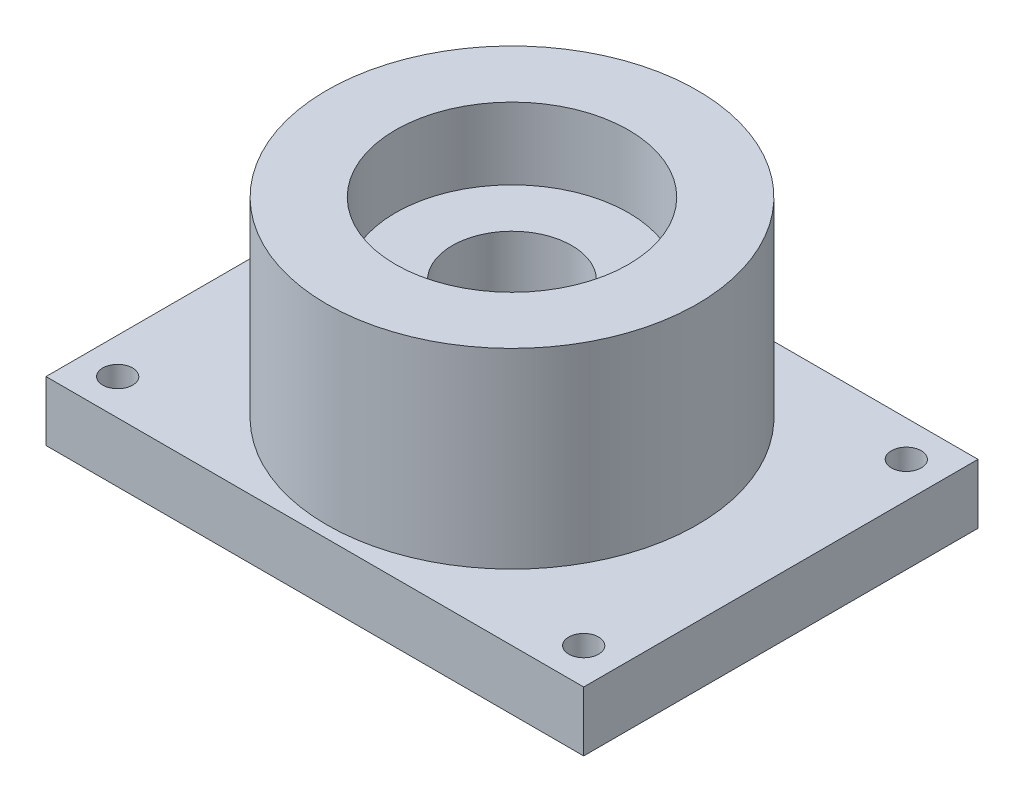
ISO-10303-21;
HEADER;
FILE_DESCRIPTION(('STEP AP214'),'2;1');
FILE_NAME('part.step','',(''),(''),'','','');
FILE_SCHEMA(('AUTOMOTIVE_DESIGN { 1 0 10303 214 1 1 1 1 }'));
ENDSEC;
DATA;
#1=APPLICATION_CONTEXT('core data for automotive mechanical design processes');
#2=APPLICATION_PROTOCOL_DEFINITION('international standard','automotive_design',2000,#1);
#3=PRODUCT_CONTEXT('',#1,'mechanical');
#4=PRODUCT('Part','Part','',(#3));
#5=PRODUCT_RELATED_PRODUCT_CATEGORY('part','',(#4));
#6=PRODUCT_DEFINITION_FORMATION('','',#4);
#7=PRODUCT_DEFINITION_CONTEXT('part definition',#1,'design');
#8=PRODUCT_DEFINITION('design','',#6,#7);
#9=PRODUCT_DEFINITION_SHAPE('','',#8);
#10=(LENGTH_UNIT() NAMED_UNIT(*) SI_UNIT(.MILLI.,.METRE.));
#11=(NAMED_UNIT(*) PLANE_ANGLE_UNIT() SI_UNIT($,.RADIAN.));
#12=(NAMED_UNIT(*) SI_UNIT($,.STERADIAN.) SOLID_ANGLE_UNIT());
#13=UNCERTAINTY_MEASURE_WITH_UNIT(LENGTH_MEASURE(1.E-05),#10,'distance_accuracy_value','');
#14=(GEOMETRIC_REPRESENTATION_CONTEXT(3) GLOBAL_UNCERTAINTY_ASSIGNED_CONTEXT((#13)) GLOBAL_UNIT_ASSIGNED_CONTEXT((#10,
#11,#12)) REPRESENTATION_CONTEXT('',''));
#15=CARTESIAN_POINT('',(0.,0.,0.));
#16=DIRECTION('',(0.,0.,1.));
#17=DIRECTION('',(1.,0.,0.));
#18=AXIS2_PLACEMENT_3D('',#15,#16,#17);
#19=CARTESIAN_POINT('',(0.,16.,0.));
#20=DIRECTION('',(0.,-1.,0.));
#21=DIRECTION('',(0.,0.,-1.));
#22=AXIS2_PLACEMENT_3D('',#19,#20,#21);
#23=CYLINDRICAL_SURFACE('',#22,15.5);
#24=CARTESIAN_POINT('',(0.,16.,0.));
#25=DIRECTION('',(0.,1.,0.));
#26=DIRECTION('',(0.,0.,1.));
#27=AXIS2_PLACEMENT_3D('',#24,#25,#26);
#28=CIRCLE('',#27,15.5);
#29=CARTESIAN_POINT('',(0.,16.,15.5));
#30=VERTEX_POINT('',#29);
#31=EDGE_CURVE('E11',#30,#30,#28,.T.);
#32=ORIENTED_EDGE('',*,*,#31,.F.);
#33=EDGE_LOOP('',(#32));
#34=FACE_BOUND('',#33,.T.);
#35=CARTESIAN_POINT('',(0.,0.,0.));
#36=DIRECTION('',(0.,1.,0.));
#37=DIRECTION('',(0.,0.,1.));
#38=AXIS2_PLACEMENT_3D('',#35,#36,#37);
#39=CIRCLE('',#38,15.5);
#40=CARTESIAN_POINT('',(0.,0.,15.5));
#41=VERTEX_POINT('',#40);
#42=EDGE_CURVE('E42',#41,#41,#39,.T.);
#43=ORIENTED_EDGE('',*,*,#42,.T.);
#44=EDGE_LOOP('',(#43));
#45=FACE_BOUND('',#44,.T.);
#46=ADVANCED_FACE('F33',(#34,#45),#23,.T.);
#47=CARTESIAN_POINT('',(0.,16.,0.));
#48=DIRECTION('',(0.,1.,0.));
#49=DIRECTION('',(0.,0.,1.));
#50=AXIS2_PLACEMENT_3D('',#47,#48,#49);
#51=PLANE('',#50);
#52=CARTESIAN_POINT('',(0.,16.,0.));
#53=DIRECTION('',(0.,1.,0.));
#54=DIRECTION('',(0.,0.,1.));
#55=AXIS2_PLACEMENT_3D('',#52,#53,#54);
#56=CIRCLE('',#55,9.75);
#57=CARTESIAN_POINT('',(0.,16.,9.75));
#58=VERTEX_POINT('',#57);
#59=EDGE_CURVE('E145',#58,#58,#56,.T.);
#60=ORIENTED_EDGE('',*,*,#59,.F.);
#61=EDGE_LOOP('',(#60));
#62=FACE_BOUND('',#61,.T.);
#63=ORIENTED_EDGE('',*,*,#31,.T.);
#64=EDGE_LOOP('',(#63));
#65=FACE_BOUND('',#64,.T.);
#66=ADVANCED_FACE('F165',(#62,#65),#51,.T.);
#67=CARTESIAN_POINT('',(0.,-5.,0.));
#68=DIRECTION('',(0.,-1.,0.));
#69=DIRECTION('',(0.,0.,-1.));
#70=AXIS2_PLACEMENT_3D('',#67,#68,#69);
#71=PLANE('',#70);
#72=CARTESIAN_POINT('',(0.,-5.,0.));
#73=DIRECTION('',(0.,-1.,0.));
#74=DIRECTION('',(0.,0.,-1.));
#75=AXIS2_PLACEMENT_3D('',#72,#73,#74);
#76=CIRCLE('',#75,5.);
#77=CARTESIAN_POINT('',(0.,-5.,-5.));
#78=VERTEX_POINT('',#77);
#79=EDGE_CURVE('E36',#78,#78,#76,.T.);
#80=ORIENTED_EDGE('',*,*,#79,.F.);
#81=EDGE_LOOP('',(#80));
#82=FACE_BOUND('',#81,.T.);
#83=CARTESIAN_POINT('',(19.4999999999999,-5.,13.5));
#84=DIRECTION('',(0.,-1.,0.));
#85=DIRECTION('',(0.,0.,-1.));
#86=AXIS2_PLACEMENT_3D('',#83,#84,#85);
#87=CIRCLE('',#86,1.25);
#88=CARTESIAN_POINT('',(19.4999999999999,-5.,12.25));
#89=VERTEX_POINT('',#88);
#90=EDGE_CURVE('E149',#89,#89,#87,.T.);
#91=ORIENTED_EDGE('',*,*,#90,.F.);
#92=EDGE_LOOP('',(#91));
#93=FACE_BOUND('',#92,.T.);
#94=CARTESIAN_POINT('',(-19.5,-5.,-13.5));
#95=DIRECTION('',(0.,-1.,0.));
#96=DIRECTION('',(0.,0.,-1.));
#97=AXIS2_PLACEMENT_3D('',#94,#95,#96);
#98=CIRCLE('',#97,1.25);
#99=CARTESIAN_POINT('',(-19.5,-5.,-14.75));
#100=VERTEX_POINT('',#99);
#101=EDGE_CURVE('E106',#100,#100,#98,.T.);
#102=ORIENTED_EDGE('',*,*,#101,.F.);
#103=EDGE_LOOP('',(#102));
#104=FACE_BOUND('',#103,.T.);
#105=DIRECTION('',(0.,0.,1.));
#106=VECTOR('',#105,1.);
#107=CARTESIAN_POINT('',(22.5,-5.,16.5));
#108=LINE('',#107,#106);
#109=CARTESIAN_POINT('',(22.5,-5.,-16.5));
#110=VERTEX_POINT('',#109);
#111=CARTESIAN_POINT('',(22.5,-5.,16.5));
#112=VERTEX_POINT('',#111);
#113=EDGE_CURVE('E88',#110,#112,#108,.T.);
#114=ORIENTED_EDGE('',*,*,#113,.T.);
#115=DIRECTION('',(-1.,0.,0.));
#116=VECTOR('',#115,1.);
#117=CARTESIAN_POINT('',(-22.5,-5.,16.5));
#118=LINE('',#117,#116);
#119=CARTESIAN_POINT('',(-22.5,-5.,16.5));
#120=VERTEX_POINT('',#119);
#121=EDGE_CURVE('E82',#112,#120,#118,.T.);
#122=ORIENTED_EDGE('',*,*,#121,.T.);
#123=DIRECTION('',(0.,0.,-1.));
#124=VECTOR('',#123,1.);
#125=CARTESIAN_POINT('',(-22.5,-5.,16.5));
#126=LINE('',#125,#124);
#127=CARTESIAN_POINT('',(-22.5,-5.,-16.5));
#128=VERTEX_POINT('',#127);
#129=EDGE_CURVE('E86',#120,#128,#126,.T.);
#130=ORIENTED_EDGE('',*,*,#129,.T.);
#131=DIRECTION('',(1.,0.,0.));
#132=VECTOR('',#131,1.);
#133=CARTESIAN_POINT('',(-22.5,-5.,-16.5));
#134=LINE('',#133,#132);
#135=EDGE_CURVE('E51',#128,#110,#134,.T.);
#136=ORIENTED_EDGE('',*,*,#135,.T.);
#137=EDGE_LOOP('',(#114,#122,#130,#136));
#138=FACE_BOUND('',#137,.T.);
#139=CARTESIAN_POINT('',(19.5,-5.,-13.5));
#140=DIRECTION('',(0.,-1.,0.));
#141=DIRECTION('',(0.,0.,-1.));
#142=AXIS2_PLACEMENT_3D('',#139,#140,#141);
#143=CIRCLE('',#142,1.25);
#144=CARTESIAN_POINT('',(19.5,-5.,-14.75));
#145=VERTEX_POINT('',#144);
#146=EDGE_CURVE('E153',#145,#145,#143,.T.);
#147=ORIENTED_EDGE('',*,*,#146,.F.);
#148=EDGE_LOOP('',(#147));
#149=FACE_BOUND('',#148,.T.);
#150=CARTESIAN_POINT('',(-19.5000000000001,-5.,13.5));
#151=DIRECTION('',(0.,-1.,0.));
#152=DIRECTION('',(0.,0.,-1.));
#153=AXIS2_PLACEMENT_3D('',#150,#151,#152);
#154=CIRCLE('',#153,1.25);
#155=CARTESIAN_POINT('',(-19.5000000000001,-5.,12.25));
#156=VERTEX_POINT('',#155);
#157=EDGE_CURVE('E139',#156,#156,#154,.T.);
#158=ORIENTED_EDGE('',*,*,#157,.F.);
#159=EDGE_LOOP('',(#158));
#160=FACE_BOUND('',#159,.T.);
#161=ADVANCED_FACE('F83',(#82,#93,#104,#138,#149,#160),#71,.T.);
#162=CARTESIAN_POINT('',(0.,0.,0.));
#163=DIRECTION('',(0.,-1.,0.));
#164=DIRECTION('',(0.,0.,-1.));
#165=AXIS2_PLACEMENT_3D('',#162,#163,#164);
#166=PLANE('',#165);
#167=ORIENTED_EDGE('',*,*,#42,.F.);
#168=EDGE_LOOP('',(#167));
#169=FACE_BOUND('',#168,.T.);
#170=DIRECTION('',(0.,0.,1.));
#171=VECTOR('',#170,1.);
#172=CARTESIAN_POINT('',(22.5,0.,16.5));
#173=LINE('',#172,#171);
#174=CARTESIAN_POINT('',(22.5,0.,-16.5));
#175=VERTEX_POINT('',#174);
#176=CARTESIAN_POINT('',(22.5,0.,16.5));
#177=VERTEX_POINT('',#176);
#178=EDGE_CURVE('E103',#175,#177,#173,.T.);
#179=ORIENTED_EDGE('',*,*,#178,.F.);
#180=DIRECTION('',(1.,0.,0.));
#181=VECTOR('',#180,1.);
#182=CARTESIAN_POINT('',(-22.5,0.,-16.5));
#183=LINE('',#182,#181);
#184=CARTESIAN_POINT('',(-22.5,0.,-16.5));
#185=VERTEX_POINT('',#184);
#186=EDGE_CURVE('E74',#185,#175,#183,.T.);
#187=ORIENTED_EDGE('',*,*,#186,.F.);
#188=DIRECTION('',(0.,0.,-1.));
#189=VECTOR('',#188,1.);
#190=CARTESIAN_POINT('',(-22.5,0.,16.5));
#191=LINE('',#190,#189);
#192=CARTESIAN_POINT('',(-22.5,0.,16.5));
#193=VERTEX_POINT('',#192);
#194=EDGE_CURVE('E68',#193,#185,#191,.T.);
#195=ORIENTED_EDGE('',*,*,#194,.F.);
#196=DIRECTION('',(-1.,0.,0.));
#197=VECTOR('',#196,1.);
#198=CARTESIAN_POINT('',(-22.5,0.,16.5));
#199=LINE('',#198,#197);
#200=EDGE_CURVE('E93',#177,#193,#199,.T.);
#201=ORIENTED_EDGE('',*,*,#200,.F.);
#202=EDGE_LOOP('',(#179,#187,#195,#201));
#203=FACE_BOUND('',#202,.T.);
#204=CARTESIAN_POINT('',(-19.5,0.,-13.5));
#205=DIRECTION('',(0.,-1.,0.));
#206=DIRECTION('',(0.,0.,-1.));
#207=AXIS2_PLACEMENT_3D('',#204,#205,#206);
#208=CIRCLE('',#207,1.25);
#209=CARTESIAN_POINT('',(-19.5,0.,-14.75));
#210=VERTEX_POINT('',#209);
#211=EDGE_CURVE('E126',#210,#210,#208,.T.);
#212=ORIENTED_EDGE('',*,*,#211,.T.);
#213=EDGE_LOOP('',(#212));
#214=FACE_BOUND('',#213,.T.);
#215=CARTESIAN_POINT('',(19.5,0.,-13.5));
#216=DIRECTION('',(0.,-1.,0.));
#217=DIRECTION('',(0.,0.,-1.));
#218=AXIS2_PLACEMENT_3D('',#215,#216,#217);
#219=CIRCLE('',#218,1.25);
#220=CARTESIAN_POINT('',(19.5,0.,-14.75));
#221=VERTEX_POINT('',#220);
#222=EDGE_CURVE('E130',#221,#221,#219,.T.);
#223=ORIENTED_EDGE('',*,*,#222,.T.);
#224=EDGE_LOOP('',(#223));
#225=FACE_BOUND('',#224,.T.);
#226=CARTESIAN_POINT('',(19.4999999999999,0.,13.5));
#227=DIRECTION('',(0.,-1.,0.));
#228=DIRECTION('',(0.,0.,-1.));
#229=AXIS2_PLACEMENT_3D('',#226,#227,#228);
#230=CIRCLE('',#229,1.25);
#231=CARTESIAN_POINT('',(19.4999999999999,0.,12.25));
#232=VERTEX_POINT('',#231);
#233=EDGE_CURVE('E134',#232,#232,#230,.T.);
#234=ORIENTED_EDGE('',*,*,#233,.T.);
#235=EDGE_LOOP('',(#234));
#236=FACE_BOUND('',#235,.T.);
#237=CARTESIAN_POINT('',(-19.5000000000001,0.,13.5));
#238=DIRECTION('',(0.,-1.,0.));
#239=DIRECTION('',(0.,0.,-1.));
#240=AXIS2_PLACEMENT_3D('',#237,#238,#239);
#241=CIRCLE('',#240,1.25);
#242=CARTESIAN_POINT('',(-19.5000000000001,0.,12.25));
#243=VERTEX_POINT('',#242);
#244=EDGE_CURVE('E137',#243,#243,#241,.T.);
#245=ORIENTED_EDGE('',*,*,#244,.T.);
#246=EDGE_LOOP('',(#245));
#247=FACE_BOUND('',#246,.T.);
#248=ADVANCED_FACE('F116',(#169,#203,#214,#225,#236,#247),#166,.F.);
#249=CARTESIAN_POINT('',(22.5,-5.,16.5));
#250=DIRECTION('',(-1.,0.,0.));
#251=DIRECTION('',(0.,0.,1.));
#252=AXIS2_PLACEMENT_3D('',#249,#250,#251);
#253=PLANE('',#252);
#254=ORIENTED_EDGE('',*,*,#178,.T.);
#255=DIRECTION('',(0.,1.,0.));
#256=VECTOR('',#255,1.);
#257=CARTESIAN_POINT('',(22.5,-5.,16.5));
#258=LINE('',#257,#256);
#259=EDGE_CURVE('E94',#112,#177,#258,.T.);
#260=ORIENTED_EDGE('',*,*,#259,.F.);
#261=ORIENTED_EDGE('',*,*,#113,.F.);
#262=DIRECTION('',(0.,1.,0.));
#263=VECTOR('',#262,1.);
#264=CARTESIAN_POINT('',(22.5,-5.,-16.5));
#265=LINE('',#264,#263);
#266=EDGE_CURVE('E99',#110,#175,#265,.T.);
#267=ORIENTED_EDGE('',*,*,#266,.T.);
#268=EDGE_LOOP('',(#254,#260,#261,#267));
#269=FACE_BOUND('',#268,.T.);
#270=ADVANCED_FACE('F119',(#269),#253,.F.);
#271=CARTESIAN_POINT('',(-22.5,-5.,16.5));
#272=DIRECTION('',(0.,0.,-1.));
#273=DIRECTION('',(-1.,0.,0.));
#274=AXIS2_PLACEMENT_3D('',#271,#272,#273);
#275=PLANE('',#274);
#276=ORIENTED_EDGE('',*,*,#200,.T.);
#277=DIRECTION('',(0.,1.,0.));
#278=VECTOR('',#277,1.);
#279=CARTESIAN_POINT('',(-22.5,-5.,16.5));
#280=LINE('',#279,#278);
#281=EDGE_CURVE('E91',#120,#193,#280,.T.);
#282=ORIENTED_EDGE('',*,*,#281,.F.);
#283=ORIENTED_EDGE('',*,*,#121,.F.);
#284=ORIENTED_EDGE('',*,*,#259,.T.);
#285=EDGE_LOOP('',(#276,#282,#283,#284));
#286=FACE_BOUND('',#285,.T.);
#287=ADVANCED_FACE('F92',(#286),#275,.F.);
#288=CARTESIAN_POINT('',(-22.5,-5.,16.5));
#289=DIRECTION('',(1.,0.,0.));
#290=DIRECTION('',(0.,0.,-1.));
#291=AXIS2_PLACEMENT_3D('',#288,#289,#290);
#292=PLANE('',#291);
#293=ORIENTED_EDGE('',*,*,#194,.T.);
#294=DIRECTION('',(0.,1.,0.));
#295=VECTOR('',#294,1.);
#296=CARTESIAN_POINT('',(-22.5,-5.,-16.5));
#297=LINE('',#296,#295);
#298=EDGE_CURVE('E95',#128,#185,#297,.T.);
#299=ORIENTED_EDGE('',*,*,#298,.F.);
#300=ORIENTED_EDGE('',*,*,#129,.F.);
#301=ORIENTED_EDGE('',*,*,#281,.T.);
#302=EDGE_LOOP('',(#293,#299,#300,#301));
#303=FACE_BOUND('',#302,.T.);
#304=ADVANCED_FACE('F97',(#303),#292,.F.);
#305=CARTESIAN_POINT('',(-22.5,-5.,-16.5));
#306=DIRECTION('',(0.,0.,1.));
#307=DIRECTION('',(1.,0.,0.));
#308=AXIS2_PLACEMENT_3D('',#305,#306,#307);
#309=PLANE('',#308);
#310=ORIENTED_EDGE('',*,*,#186,.T.);
#311=ORIENTED_EDGE('',*,*,#266,.F.);
#312=ORIENTED_EDGE('',*,*,#135,.F.);
#313=ORIENTED_EDGE('',*,*,#298,.T.);
#314=EDGE_LOOP('',(#310,#311,#312,#313));
#315=FACE_BOUND('',#314,.T.);
#316=ADVANCED_FACE('F244',(#315),#309,.F.);
#317=CARTESIAN_POINT('',(-19.5,-5.,-13.5));
#318=DIRECTION('',(0.,1.,0.));
#319=DIRECTION('',(0.,0.,1.));
#320=AXIS2_PLACEMENT_3D('',#317,#318,#319);
#321=CYLINDRICAL_SURFACE('',#320,1.25);
#322=ORIENTED_EDGE('',*,*,#101,.T.);
#323=EDGE_LOOP('',(#322));
#324=FACE_BOUND('',#323,.T.);
#325=ORIENTED_EDGE('',*,*,#211,.F.);
#326=EDGE_LOOP('',(#325));
#327=FACE_BOUND('',#326,.T.);
#328=ADVANCED_FACE('F161',(#324,#327),#321,.F.);
#329=CARTESIAN_POINT('',(19.5,-5.,-13.5));
#330=DIRECTION('',(0.,1.,0.));
#331=DIRECTION('',(0.,0.,1.));
#332=AXIS2_PLACEMENT_3D('',#329,#330,#331);
#333=CYLINDRICAL_SURFACE('',#332,1.25);
#334=ORIENTED_EDGE('',*,*,#146,.T.);
#335=EDGE_LOOP('',(#334));
#336=FACE_BOUND('',#335,.T.);
#337=ORIENTED_EDGE('',*,*,#222,.F.);
#338=EDGE_LOOP('',(#337));
#339=FACE_BOUND('',#338,.T.);
#340=ADVANCED_FACE('F239',(#336,#339),#333,.F.);
#341=CARTESIAN_POINT('',(19.4999999999999,-5.,13.5));
#342=DIRECTION('',(0.,1.,0.));
#343=DIRECTION('',(0.,0.,1.));
#344=AXIS2_PLACEMENT_3D('',#341,#342,#343);
#345=CYLINDRICAL_SURFACE('',#344,1.25);
#346=ORIENTED_EDGE('',*,*,#90,.T.);
#347=EDGE_LOOP('',(#346));
#348=FACE_BOUND('',#347,.T.);
#349=ORIENTED_EDGE('',*,*,#233,.F.);
#350=EDGE_LOOP('',(#349));
#351=FACE_BOUND('',#350,.T.);
#352=ADVANCED_FACE('F235',(#348,#351),#345,.F.);
#353=CARTESIAN_POINT('',(-19.5000000000001,-5.,13.5));
#354=DIRECTION('',(0.,1.,0.));
#355=DIRECTION('',(0.,0.,1.));
#356=AXIS2_PLACEMENT_3D('',#353,#354,#355);
#357=CYLINDRICAL_SURFACE('',#356,1.25);
#358=ORIENTED_EDGE('',*,*,#157,.T.);
#359=EDGE_LOOP('',(#358));
#360=FACE_BOUND('',#359,.T.);
#361=ORIENTED_EDGE('',*,*,#244,.F.);
#362=EDGE_LOOP('',(#361));
#363=FACE_BOUND('',#362,.T.);
#364=ADVANCED_FACE('F193',(#360,#363),#357,.F.);
#365=CARTESIAN_POINT('',(0.,10.,0.));
#366=DIRECTION('',(0.,1.,0.));
#367=DIRECTION('',(0.,0.,1.));
#368=AXIS2_PLACEMENT_3D('',#365,#366,#367);
#369=CYLINDRICAL_SURFACE('',#368,9.75);
#370=CARTESIAN_POINT('',(0.,10.,0.));
#371=DIRECTION('',(0.,1.,0.));
#372=DIRECTION('',(0.,0.,1.));
#373=AXIS2_PLACEMENT_3D('',#370,#371,#372);
#374=CIRCLE('',#373,9.75);
#375=CARTESIAN_POINT('',(0.,10.,9.75));
#376=VERTEX_POINT('',#375);
#377=EDGE_CURVE('E140',#376,#376,#374,.T.);
#378=ORIENTED_EDGE('',*,*,#377,.F.);
#379=EDGE_LOOP('',(#378));
#380=FACE_BOUND('',#379,.T.);
#381=ORIENTED_EDGE('',*,*,#59,.T.);
#382=EDGE_LOOP('',(#381));
#383=FACE_BOUND('',#382,.T.);
#384=ADVANCED_FACE('F198',(#380,#383),#369,.F.);
#385=CARTESIAN_POINT('',(0.,10.,0.));
#386=DIRECTION('',(0.,1.,0.));
#387=DIRECTION('',(0.,0.,1.));
#388=AXIS2_PLACEMENT_3D('',#385,#386,#387);
#389=PLANE('',#388);
#390=CARTESIAN_POINT('',(0.,10.,0.));
#391=DIRECTION('',(0.,1.,0.));
#392=DIRECTION('',(0.,0.,1.));
#393=AXIS2_PLACEMENT_3D('',#390,#391,#392);
#394=CIRCLE('',#393,5.);
#395=CARTESIAN_POINT('',(0.,10.,5.));
#396=VERTEX_POINT('',#395);
#397=EDGE_CURVE('E310',#396,#396,#394,.T.);
#398=ORIENTED_EDGE('',*,*,#397,.F.);
#399=EDGE_LOOP('',(#398));
#400=FACE_BOUND('',#399,.T.);
#401=ORIENTED_EDGE('',*,*,#377,.T.);
#402=EDGE_LOOP('',(#401));
#403=FACE_BOUND('',#402,.T.);
#404=ADVANCED_FACE('F202',(#400,#403),#389,.T.);
#405=CARTESIAN_POINT('',(0.,-9.,0.));
#406=DIRECTION('',(0.,1.,0.));
#407=DIRECTION('',(0.,0.,1.));
#408=AXIS2_PLACEMENT_3D('',#405,#406,#407);
#409=CYLINDRICAL_SURFACE('',#408,5.);
#410=ORIENTED_EDGE('',*,*,#79,.T.);
#411=EDGE_LOOP('',(#410));
#412=FACE_BOUND('',#411,.T.);
#413=ORIENTED_EDGE('',*,*,#397,.T.);
#414=EDGE_LOOP('',(#413));
#415=FACE_BOUND('',#414,.T.);
#416=ADVANCED_FACE('F217',(#412,#415),#409,.F.);
#417=CLOSED_SHELL('',(#46,#66,#161,#248,#270,#287,#304,#316,#328,#340,#352,#364,#384,#404,#416));
#418=MANIFOLD_SOLID_BREP('B2',#417);
#419=ADVANCED_BREP_SHAPE_REPRESENTATION('',(#18,#418),#14);
#420=SHAPE_DEFINITION_REPRESENTATION(#9,#419);
ENDSEC;
END-ISO-10303-21;
